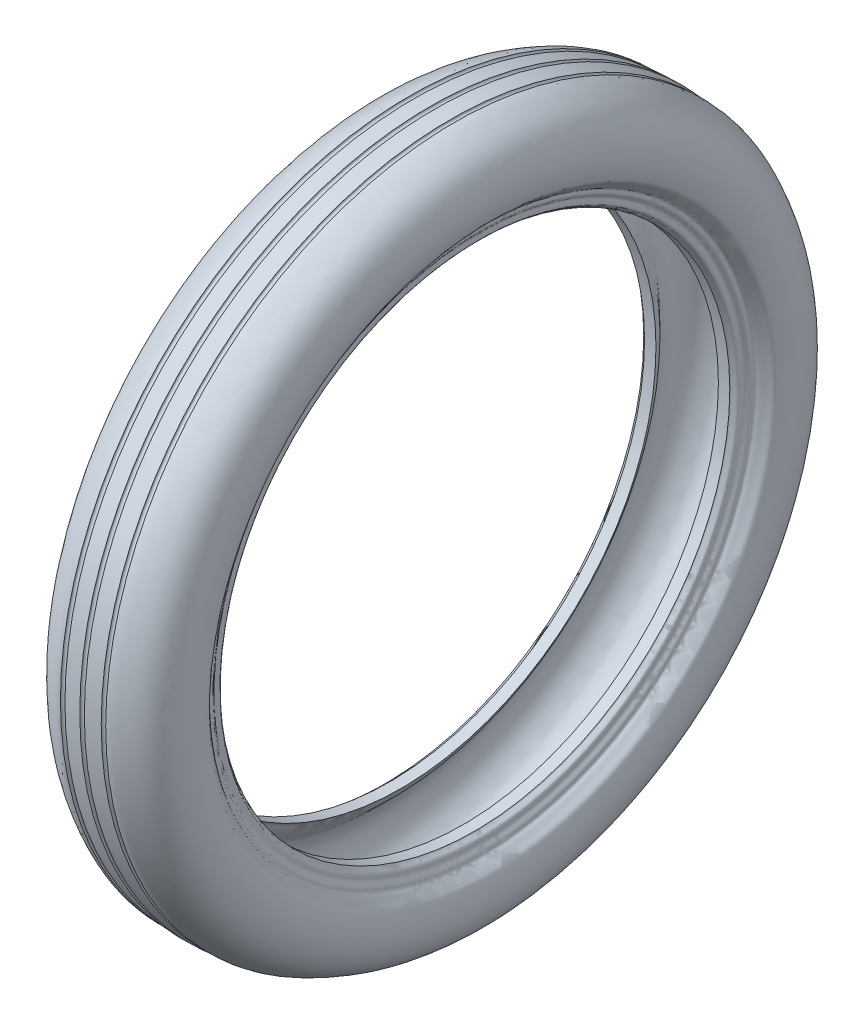
ISO-10303-21;
HEADER;
FILE_DESCRIPTION(('STEP AP214'),'2;1');
FILE_NAME('part.step','',(''),(''),'','','');
FILE_SCHEMA(('AUTOMOTIVE_DESIGN { 1 0 10303 214 1 1 1 1 }'));
ENDSEC;
DATA;
#1=APPLICATION_CONTEXT('core data for automotive mechanical design processes');
#2=APPLICATION_PROTOCOL_DEFINITION('international standard','automotive_design',2000,#1);
#3=PRODUCT_CONTEXT('',#1,'mechanical');
#4=PRODUCT('Part','Part','',(#3));
#5=PRODUCT_RELATED_PRODUCT_CATEGORY('part','',(#4));
#6=PRODUCT_DEFINITION_FORMATION('','',#4);
#7=PRODUCT_DEFINITION_CONTEXT('part definition',#1,'design');
#8=PRODUCT_DEFINITION('design','',#6,#7);
#9=PRODUCT_DEFINITION_SHAPE('','',#8);
#10=(LENGTH_UNIT() NAMED_UNIT(*) SI_UNIT(.MILLI.,.METRE.));
#11=(NAMED_UNIT(*) PLANE_ANGLE_UNIT() SI_UNIT($,.RADIAN.));
#12=(NAMED_UNIT(*) SI_UNIT($,.STERADIAN.) SOLID_ANGLE_UNIT());
#13=UNCERTAINTY_MEASURE_WITH_UNIT(LENGTH_MEASURE(1.E-05),#10,'distance_accuracy_value','');
#14=(GEOMETRIC_REPRESENTATION_CONTEXT(3) GLOBAL_UNCERTAINTY_ASSIGNED_CONTEXT((#13)) GLOBAL_UNIT_ASSIGNED_CONTEXT((#10,
#11,#12)) REPRESENTATION_CONTEXT('',''));
#15=CARTESIAN_POINT('',(0.,0.,0.));
#16=DIRECTION('',(0.,0.,1.));
#17=DIRECTION('',(1.,0.,0.));
#18=AXIS2_PLACEMENT_3D('',#15,#16,#17);
#19=CARTESIAN_POINT('',(-24.8172630139917,203.,0.));
#20=CARTESIAN_POINT('',(-27.2283998288289,205.06391431928,0.));
#21=CARTESIAN_POINT('',(-28.5496427344952,210.327625908058,0.));
#22=CARTESIAN_POINT('',(-33.6712545353592,215.019378984169,0.));
#23=CARTESIAN_POINT('',(-37.7772976660351,219.010363555149,0.));
#24=CARTESIAN_POINT('',(-42.2633577257313,223.062020269606,0.));
#25=CARTESIAN_POINT('',(-45.1671204187017,229.55393791157,0.));
#26=CARTESIAN_POINT('',(-48.0286654197166,236.65779205585,0.));
#27=CARTESIAN_POINT('',(-47.8879674715826,244.882513096217,0.));
#28=CARTESIAN_POINT('',(-46.3948773163548,254.057111445877,0.));
#29=CARTESIAN_POINT('',(-40.3486929351291,261.403587543646,0.));
#30=CARTESIAN_POINT('',(-33.851481321555,268.81086706887,0.));
#31=CARTESIAN_POINT('',(-25.2444175261157,271.404992130535,0.));
#32=CARTESIAN_POINT('',(-16.7423312191855,273.186419121129,0.));
#33=CARTESIAN_POINT('',(-10.1405547550226,273.463220362378,0.));
#34=CARTESIAN_POINT('',(-4.54429512443643,274.014061695448,0.));
#35=CARTESIAN_POINT('',(-1.75340207589833,273.445280920895,0.));
#36=CARTESIAN_POINT('',(0.,273.651830628835,0.));
#37=B_SPLINE_CURVE_WITH_KNOTS('',3,(#19,#20,#21,#22,#23,#24,#25,#26,#27,#28,#29,#30,#31,#32,#33,
#34,#35,#36),.UNSPECIFIED.,.F.,.F.,(4,1,1,1,1,1,1,1,1,1,1,1,1,1,1,4),(0.,0.0822330624444425,
0.137617146698626,0.183009302880853,0.237253629031035,0.297469874379483,0.371716047539101,
0.44060468979368,0.515818013596818,0.616103802574389,0.690267434104086,0.776013817716258,
0.849380324821276,0.924772592656254,0.952990480004338,1.),.UNSPECIFIED.);
#38=CARTESIAN_POINT('',(-102.722911074857,0.,0.));
#39=DIRECTION('',(-1.,0.,0.));
#40=AXIS1_PLACEMENT('',#38,#39);
#41=SURFACE_OF_REVOLUTION('',#37,#40);
#42=CARTESIAN_POINT('',(0.,0.,0.));
#43=DIRECTION('',(1.,0.,0.));
#44=DIRECTION('',(0.,0.,-1.));
#45=AXIS2_PLACEMENT_3D('',#42,#43,#44);
#46=CIRCLE('',#45,273.651830628835);
#47=CARTESIAN_POINT('',(0.,0.,-273.651830628835));
#48=VERTEX_POINT('',#47);
#49=EDGE_CURVE('E10',#48,#48,#46,.T.);
#50=ORIENTED_EDGE('',*,*,#49,.T.);
#51=EDGE_LOOP('',(#50));
#52=FACE_BOUND('',#51,.T.);
#53=CARTESIAN_POINT('',(-24.8172630139917,0.,0.));
#54=DIRECTION('',(1.,0.,0.));
#55=DIRECTION('',(0.,0.,-1.));
#56=AXIS2_PLACEMENT_3D('',#53,#54,#55);
#57=CIRCLE('',#56,203.);
#58=CARTESIAN_POINT('',(-24.8172630139917,0.,-203.));
#59=VERTEX_POINT('',#58);
#60=EDGE_CURVE('E69',#59,#59,#57,.T.);
#61=ORIENTED_EDGE('',*,*,#60,.F.);
#62=EDGE_LOOP('',(#61));
#63=FACE_BOUND('',#62,.T.);
#64=ADVANCED_FACE('F31',(#52,#63),#41,.T.);
#65=CARTESIAN_POINT('',(0.,273.651830628835,0.));
#66=CARTESIAN_POINT('',(1.7534020758983,273.445280920895,0.));
#67=CARTESIAN_POINT('',(4.5442951244364,274.014061695448,0.));
#68=CARTESIAN_POINT('',(10.1405547550225,273.463220362378,0.));
#69=CARTESIAN_POINT('',(16.7423312191854,273.18641912113,0.));
#70=CARTESIAN_POINT('',(25.2444175261157,271.404992130535,0.));
#71=CARTESIAN_POINT('',(33.851481321555,268.81086706887,0.));
#72=CARTESIAN_POINT('',(40.3486929351291,261.403587543646,0.));
#73=CARTESIAN_POINT('',(46.3948773163547,254.057111445877,0.));
#74=CARTESIAN_POINT('',(47.8879674715826,244.882513096217,0.));
#75=CARTESIAN_POINT('',(48.0286654197166,236.65779205585,0.));
#76=CARTESIAN_POINT('',(45.1671204187017,229.55393791157,0.));
#77=CARTESIAN_POINT('',(42.2633577257312,223.062020269606,0.));
#78=CARTESIAN_POINT('',(37.7772976660351,219.010363555149,0.));
#79=CARTESIAN_POINT('',(33.6712545353592,215.019378984169,0.));
#80=CARTESIAN_POINT('',(28.5496427344952,210.327625908058,0.));
#81=CARTESIAN_POINT('',(27.2283998288289,205.06391431928,0.));
#82=CARTESIAN_POINT('',(24.8172630139916,203.,0.));
#83=B_SPLINE_CURVE_WITH_KNOTS('',3,(#65,#66,#67,#68,#69,#70,#71,#72,#73,#74,#75,#76,#77,#78,#79,
#80,#81,#82),.UNSPECIFIED.,.F.,.F.,(4,1,1,1,1,1,1,1,1,1,1,1,1,1,1,4),(0.,0.0470095199956621,
0.0752274073437459,0.150619675178724,0.223986182283742,0.309732565895914,0.383896197425612,
0.484181986403182,0.55939531020632,0.628283952460899,0.702530125620518,0.762746370968965,
0.816990697119147,0.862382853301374,0.917766937555557,1.),.UNSPECIFIED.);
#84=CARTESIAN_POINT('',(-102.722911074857,0.,0.));
#85=DIRECTION('',(-1.,0.,0.));
#86=AXIS1_PLACEMENT('',#84,#85);
#87=SURFACE_OF_REVOLUTION('',#83,#86);
#88=CARTESIAN_POINT('',(24.8172630139917,0.,0.));
#89=DIRECTION('',(1.,0.,0.));
#90=DIRECTION('',(0.,0.,-1.));
#91=AXIS2_PLACEMENT_3D('',#88,#89,#90);
#92=CIRCLE('',#91,203.);
#93=CARTESIAN_POINT('',(24.8172630139917,0.,-203.));
#94=VERTEX_POINT('',#93);
#95=EDGE_CURVE('E38',#94,#94,#92,.T.);
#96=ORIENTED_EDGE('',*,*,#95,.T.);
#97=EDGE_LOOP('',(#96));
#98=FACE_BOUND('',#97,.T.);
#99=ORIENTED_EDGE('',*,*,#49,.F.);
#100=EDGE_LOOP('',(#99));
#101=FACE_BOUND('',#100,.T.);
#102=ADVANCED_FACE('F116',(#98,#101),#87,.T.);
#103=CARTESIAN_POINT('',(-102.722911074857,0.,0.));
#104=DIRECTION('',(-1.,0.,0.));
#105=DIRECTION('',(0.,0.,-1.));
#106=AXIS2_PLACEMENT_3D('',#103,#104,#105);
#107=CYLINDRICAL_SURFACE('',#106,203.);
#108=CARTESIAN_POINT('',(33.9052748219322,0.,0.));
#109=DIRECTION('',(1.,0.,0.));
#110=DIRECTION('',(0.,0.,-1.));
#111=AXIS2_PLACEMENT_3D('',#108,#109,#110);
#112=CIRCLE('',#111,203.);
#113=CARTESIAN_POINT('',(33.9052748219322,0.,-203.));
#114=VERTEX_POINT('',#113);
#115=EDGE_CURVE('E42',#114,#114,#112,.T.);
#116=ORIENTED_EDGE('',*,*,#115,.T.);
#117=EDGE_LOOP('',(#116));
#118=FACE_BOUND('',#117,.T.);
#119=ORIENTED_EDGE('',*,*,#95,.F.);
#120=EDGE_LOOP('',(#119));
#121=FACE_BOUND('',#120,.T.);
#122=ADVANCED_FACE('F113',(#118,#121),#107,.F.);
#123=CARTESIAN_POINT('',(33.9052748219323,203.,0.));
#124=CARTESIAN_POINT('',(34.4514477122976,204.223315441255,0.));
#125=CARTESIAN_POINT('',(38.405176851135,205.210772848352,0.));
#126=CARTESIAN_POINT('',(37.5895196663085,208.702454770499,0.));
#127=CARTESIAN_POINT('',(37.3176730115443,211.637363166268,0.));
#128=CARTESIAN_POINT('',(40.3679293440638,213.465220786409,0.));
#129=CARTESIAN_POINT('',(39.0660676586276,217.086806756293,0.));
#130=CARTESIAN_POINT('',(42.5299588621192,218.987124675277,0.));
#131=CARTESIAN_POINT('',(44.4812031460707,222.024976144124,0.));
#132=CARTESIAN_POINT('',(48.1613248996428,224.664233070907,0.));
#133=CARTESIAN_POINT('',(49.3373100798012,231.297261903147,0.));
#134=CARTESIAN_POINT('',(50.5659703704679,239.217588361253,0.));
#135=CARTESIAN_POINT('',(49.5419089182548,249.309832870114,0.));
#136=CARTESIAN_POINT('',(46.4257794125868,258.785832909676,0.));
#137=CARTESIAN_POINT('',(40.6849116029119,266.454028141102,0.));
#138=CARTESIAN_POINT('',(33.8688282793654,271.544671240841,0.));
#139=CARTESIAN_POINT('',(26.5848661668035,275.239525498986,0.));
#140=CARTESIAN_POINT('',(21.3849500525043,277.770418692312,0.));
#141=CARTESIAN_POINT('',(18.0012541580362,277.496758701426,0.));
#142=B_SPLINE_CURVE_WITH_KNOTS('',3,(#123,#124,#125,#126,#127,#128,#129,#130,#131,#132,#133,
#134,#135,#136,#137,#138,#139,#140,#141),.UNSPECIFIED.,.F.,.F.,(4,1,1,1,1,1,1,1,1,1,1,1,1,1,1,1,
4),(0.,0.0502849018641816,0.0809639249454713,0.0972057606943899,0.139297033110355,
0.164562110942005,0.195188010133947,0.242420179219544,0.280702553209471,0.328072425704126,
0.440671496514186,0.53314982377352,0.638161135079807,0.746440040072595,0.823682365401741,
0.89958494243369,1.),.UNSPECIFIED.);
#143=CARTESIAN_POINT('',(-102.722911074857,0.,0.));
#144=DIRECTION('',(-1.,0.,0.));
#145=AXIS1_PLACEMENT('',#143,#144);
#146=SURFACE_OF_REVOLUTION('',#142,#145);
#147=CARTESIAN_POINT('',(18.0012541580362,0.,0.));
#148=DIRECTION('',(1.,0.,0.));
#149=DIRECTION('',(0.,0.,-1.));
#150=AXIS2_PLACEMENT_3D('',#147,#148,#149);
#151=CIRCLE('',#150,277.496758701426);
#152=CARTESIAN_POINT('',(18.0012541580362,0.,-277.496758701426));
#153=VERTEX_POINT('',#152);
#154=EDGE_CURVE('E46',#153,#153,#151,.T.);
#155=ORIENTED_EDGE('',*,*,#154,.T.);
#156=EDGE_LOOP('',(#155));
#157=FACE_BOUND('',#156,.T.);
#158=ORIENTED_EDGE('',*,*,#115,.F.);
#159=EDGE_LOOP('',(#158));
#160=FACE_BOUND('',#159,.T.);
#161=ADVANCED_FACE('F109',(#157,#160),#146,.T.);
#162=CARTESIAN_POINT('',(16.2157456896604,0.,0.));
#163=DIRECTION('',(-1.,0.,0.));
#164=DIRECTION('',(0.,0.,-1.));
#165=AXIS2_PLACEMENT_3D('',#162,#163,#164);
#166=TOROIDAL_SURFACE('',#165,277.496758701426,1.7855084683758);
#167=CARTESIAN_POINT('',(14.4302372212846,0.,0.));
#168=DIRECTION('',(1.,0.,0.));
#169=DIRECTION('',(0.,0.,-1.));
#170=AXIS2_PLACEMENT_3D('',#167,#168,#169);
#171=CIRCLE('',#170,277.496758701426);
#172=CARTESIAN_POINT('',(14.4302372212846,0.,-277.496758701426));
#173=VERTEX_POINT('',#172);
#174=EDGE_CURVE('E51',#173,#173,#171,.T.);
#175=ORIENTED_EDGE('',*,*,#174,.T.);
#176=EDGE_LOOP('',(#175));
#177=FACE_BOUND('',#176,.T.);
#178=ORIENTED_EDGE('',*,*,#154,.F.);
#179=EDGE_LOOP('',(#178));
#180=FACE_BOUND('',#179,.T.);
#181=ADVANCED_FACE('F105',(#177,#180),#166,.F.);
#182=CARTESIAN_POINT('',(14.4302372212846,0.,0.));
#183=DIRECTION('',(-1.,0.,0.));
#184=DIRECTION('',(0.,0.,-1.));
#185=AXIS2_PLACEMENT_3D('',#182,#183,#184);
#186=CONICAL_SURFACE('',#185,277.496758701426,0.0638636091062138);
#187=CARTESIAN_POINT('',(1.81905865515339,0.,0.));
#188=DIRECTION('',(1.,0.,0.));
#189=DIRECTION('',(0.,0.,-1.));
#190=AXIS2_PLACEMENT_3D('',#187,#188,#189);
#191=CIRCLE('',#190,278.303250820303);
#192=CARTESIAN_POINT('',(1.81905865515339,0.,-278.303250820303));
#193=VERTEX_POINT('',#192);
#194=EDGE_CURVE('E54',#193,#193,#191,.T.);
#195=ORIENTED_EDGE('',*,*,#194,.T.);
#196=EDGE_LOOP('',(#195));
#197=FACE_BOUND('',#196,.T.);
#198=ORIENTED_EDGE('',*,*,#174,.F.);
#199=EDGE_LOOP('',(#198));
#200=FACE_BOUND('',#199,.T.);
#201=ADVANCED_FACE('F101',(#197,#200),#186,.T.);
#202=CARTESIAN_POINT('',(0.,0.,0.));
#203=DIRECTION('',(-1.,0.,0.));
#204=DIRECTION('',(0.,0.,-1.));
#205=AXIS2_PLACEMENT_3D('',#202,#203,#204);
#206=TOROIDAL_SURFACE('',#205,278.303250820303,1.8190586551534);
#207=CARTESIAN_POINT('',(-1.81905865515342,0.,0.));
#208=DIRECTION('',(1.,0.,0.));
#209=DIRECTION('',(0.,0.,-1.));
#210=AXIS2_PLACEMENT_3D('',#207,#208,#209);
#211=CIRCLE('',#210,278.303250820303);
#212=CARTESIAN_POINT('',(-1.81905865515342,0.,-278.303250820303));
#213=VERTEX_POINT('',#212);
#214=EDGE_CURVE('E57',#213,#213,#211,.T.);
#215=ORIENTED_EDGE('',*,*,#214,.T.);
#216=EDGE_LOOP('',(#215));
#217=FACE_BOUND('',#216,.T.);
#218=ORIENTED_EDGE('',*,*,#194,.F.);
#219=EDGE_LOOP('',(#218));
#220=FACE_BOUND('',#219,.T.);
#221=ADVANCED_FACE('F97',(#217,#220),#206,.F.);
#222=CARTESIAN_POINT('',(-1.81905865515342,0.,0.));
#223=DIRECTION('',(1.,0.,0.));
#224=DIRECTION('',(0.,0.,1.));
#225=AXIS2_PLACEMENT_3D('',#222,#223,#224);
#226=CONICAL_SURFACE('',#225,278.303250820303,0.0638636091062136);
#227=CARTESIAN_POINT('',(-14.4302372212846,0.,0.));
#228=DIRECTION('',(1.,0.,0.));
#229=DIRECTION('',(0.,0.,-1.));
#230=AXIS2_PLACEMENT_3D('',#227,#228,#229);
#231=CIRCLE('',#230,277.496758701426);
#232=CARTESIAN_POINT('',(-14.4302372212846,0.,-277.496758701426));
#233=VERTEX_POINT('',#232);
#234=EDGE_CURVE('E60',#233,#233,#231,.T.);
#235=ORIENTED_EDGE('',*,*,#234,.T.);
#236=EDGE_LOOP('',(#235));
#237=FACE_BOUND('',#236,.T.);
#238=ORIENTED_EDGE('',*,*,#214,.F.);
#239=EDGE_LOOP('',(#238));
#240=FACE_BOUND('',#239,.T.);
#241=ADVANCED_FACE('F93',(#237,#240),#226,.T.);
#242=CARTESIAN_POINT('',(-16.2157456896604,0.,0.));
#243=DIRECTION('',(-1.,0.,0.));
#244=DIRECTION('',(0.,0.,-1.));
#245=AXIS2_PLACEMENT_3D('',#242,#243,#244);
#246=TOROIDAL_SURFACE('',#245,277.496758701426,1.78550846837579);
#247=CARTESIAN_POINT('',(-18.0012541580362,0.,0.));
#248=DIRECTION('',(1.,0.,0.));
#249=DIRECTION('',(0.,0.,-1.));
#250=AXIS2_PLACEMENT_3D('',#247,#248,#249);
#251=CIRCLE('',#250,277.496758701426);
#252=CARTESIAN_POINT('',(-18.0012541580362,0.,-277.496758701426));
#253=VERTEX_POINT('',#252);
#254=EDGE_CURVE('E63',#253,#253,#251,.T.);
#255=ORIENTED_EDGE('',*,*,#254,.T.);
#256=EDGE_LOOP('',(#255));
#257=FACE_BOUND('',#256,.T.);
#258=ORIENTED_EDGE('',*,*,#234,.F.);
#259=EDGE_LOOP('',(#258));
#260=FACE_BOUND('',#259,.T.);
#261=ADVANCED_FACE('F89',(#257,#260),#246,.F.);
#262=CARTESIAN_POINT('',(-18.0012541580362,277.496758701426,0.));
#263=CARTESIAN_POINT('',(-21.3849500525043,277.770418692312,0.));
#264=CARTESIAN_POINT('',(-26.5848661668036,275.239525498986,0.));
#265=CARTESIAN_POINT('',(-33.8688282793654,271.544671240841,0.));
#266=CARTESIAN_POINT('',(-40.6849116029119,266.454028141102,0.));
#267=CARTESIAN_POINT('',(-46.4257794125869,258.785832909676,0.));
#268=CARTESIAN_POINT('',(-49.5419089182548,249.309832870114,0.));
#269=CARTESIAN_POINT('',(-50.5659703704679,239.217588361253,0.));
#270=CARTESIAN_POINT('',(-49.3373100798012,231.297261903147,0.));
#271=CARTESIAN_POINT('',(-48.1613248996428,224.664233070907,0.));
#272=CARTESIAN_POINT('',(-44.4812031460707,222.024976144124,0.));
#273=CARTESIAN_POINT('',(-42.5299588621192,218.987124675277,0.));
#274=CARTESIAN_POINT('',(-39.0660676586276,217.086806756293,0.));
#275=CARTESIAN_POINT('',(-40.3679293440638,213.465220786409,0.));
#276=CARTESIAN_POINT('',(-37.3176730115443,211.637363166268,0.));
#277=CARTESIAN_POINT('',(-37.5895196663085,208.702454770499,0.));
#278=CARTESIAN_POINT('',(-38.405176851135,205.210772848352,0.));
#279=CARTESIAN_POINT('',(-34.4514477122976,204.223315441255,0.));
#280=CARTESIAN_POINT('',(-33.9052748219323,203.,0.));
#281=B_SPLINE_CURVE_WITH_KNOTS('',3,(#262,#263,#264,#265,#266,#267,#268,#269,#270,#271,#272,
#273,#274,#275,#276,#277,#278,#279,#280),.UNSPECIFIED.,.F.,.F.,(4,1,1,1,1,1,1,1,1,1,1,1,1,1,1,1,
4),(0.,0.10041505756631,0.176317634598259,0.253559959927405,0.361838864920193,0.46685017622648,
0.559328503485814,0.671927574295874,0.719297446790528,0.757579820780456,0.804811989866053,
0.835437889057995,0.860702966889645,0.90279423930561,0.919036075054529,0.949715098135818,1.),.UNSPECIFIED.);
#282=CARTESIAN_POINT('',(-102.722911074857,0.,0.));
#283=DIRECTION('',(-1.,0.,0.));
#284=AXIS1_PLACEMENT('',#282,#283);
#285=SURFACE_OF_REVOLUTION('',#281,#284);
#286=CARTESIAN_POINT('',(-33.9052748219323,0.,0.));
#287=DIRECTION('',(1.,0.,0.));
#288=DIRECTION('',(0.,0.,-1.));
#289=AXIS2_PLACEMENT_3D('',#286,#287,#288);
#290=CIRCLE('',#289,203.);
#291=CARTESIAN_POINT('',(-33.9052748219323,0.,-203.));
#292=VERTEX_POINT('',#291);
#293=EDGE_CURVE('E66',#292,#292,#290,.T.);
#294=ORIENTED_EDGE('',*,*,#293,.T.);
#295=EDGE_LOOP('',(#294));
#296=FACE_BOUND('',#295,.T.);
#297=ORIENTED_EDGE('',*,*,#254,.F.);
#298=EDGE_LOOP('',(#297));
#299=FACE_BOUND('',#298,.T.);
#300=ADVANCED_FACE('F84',(#296,#299),#285,.T.);
#301=CARTESIAN_POINT('',(-102.722911074857,0.,0.));
#302=DIRECTION('',(-1.,0.,0.));
#303=DIRECTION('',(0.,0.,-1.));
#304=AXIS2_PLACEMENT_3D('',#301,#302,#303);
#305=CYLINDRICAL_SURFACE('',#304,203.);
#306=ORIENTED_EDGE('',*,*,#60,.T.);
#307=EDGE_LOOP('',(#306));
#308=FACE_BOUND('',#307,.T.);
#309=ORIENTED_EDGE('',*,*,#293,.F.);
#310=EDGE_LOOP('',(#309));
#311=FACE_BOUND('',#310,.T.);
#312=ADVANCED_FACE('F88',(#308,#311),#305,.F.);
#313=CLOSED_SHELL('',(#64,#102,#122,#161,#181,#201,#221,#241,#261,#300,#312));
#314=MANIFOLD_SOLID_BREP('B2',#313);
#315=ADVANCED_BREP_SHAPE_REPRESENTATION('',(#18,#314),#14);
#316=SHAPE_DEFINITION_REPRESENTATION(#9,#315);
ENDSEC;
END-ISO-10303-21;
